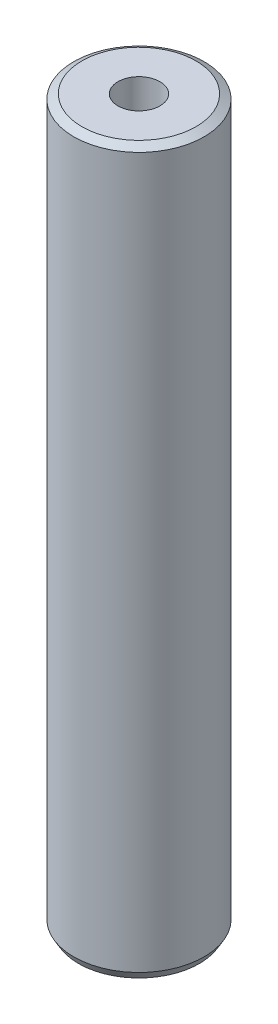
ISO-10303-21;
HEADER;
FILE_DESCRIPTION(('STEP AP214'),'2;1');
FILE_NAME('part.step','',(''),(''),'','','');
FILE_SCHEMA(('AUTOMOTIVE_DESIGN { 1 0 10303 214 1 1 1 1 }'));
ENDSEC;
DATA;
#1=APPLICATION_CONTEXT('core data for automotive mechanical design processes');
#2=APPLICATION_PROTOCOL_DEFINITION('international standard','automotive_design',2000,#1);
#3=PRODUCT_CONTEXT('',#1,'mechanical');
#4=PRODUCT('Part','Part','',(#3));
#5=PRODUCT_RELATED_PRODUCT_CATEGORY('part','',(#4));
#6=PRODUCT_DEFINITION_FORMATION('','',#4);
#7=PRODUCT_DEFINITION_CONTEXT('part definition',#1,'design');
#8=PRODUCT_DEFINITION('design','',#6,#7);
#9=PRODUCT_DEFINITION_SHAPE('','',#8);
#10=(LENGTH_UNIT() NAMED_UNIT(*) SI_UNIT(.MILLI.,.METRE.));
#11=(NAMED_UNIT(*) PLANE_ANGLE_UNIT() SI_UNIT($,.RADIAN.));
#12=(NAMED_UNIT(*) SI_UNIT($,.STERADIAN.) SOLID_ANGLE_UNIT());
#13=UNCERTAINTY_MEASURE_WITH_UNIT(LENGTH_MEASURE(1.E-05),#10,'distance_accuracy_value','');
#14=(GEOMETRIC_REPRESENTATION_CONTEXT(3) GLOBAL_UNCERTAINTY_ASSIGNED_CONTEXT((#13)) GLOBAL_UNIT_ASSIGNED_CONTEXT((#10,
#11,#12)) REPRESENTATION_CONTEXT('',''));
#15=CARTESIAN_POINT('',(0.,0.,0.));
#16=DIRECTION('',(0.,0.,1.));
#17=DIRECTION('',(1.,0.,0.));
#18=AXIS2_PLACEMENT_3D('',#15,#16,#17);
#19=CARTESIAN_POINT('',(0.,277.359548343743,0.));
#20=DIRECTION('',(0.,-1.,0.));
#21=DIRECTION('',(0.,0.,-1.));
#22=AXIS2_PLACEMENT_3D('',#19,#20,#21);
#23=CYLINDRICAL_SURFACE('',#22,25.);
#24=CARTESIAN_POINT('',(0.,275.561500703349,0.));
#25=DIRECTION('',(0.,1.,0.));
#26=DIRECTION('',(0.,0.,1.));
#27=AXIS2_PLACEMENT_3D('',#24,#25,#26);
#28=CIRCLE('',#27,25.);
#29=CARTESIAN_POINT('',(0.,275.561500703349,25.));
#30=VERTEX_POINT('',#29);
#31=EDGE_CURVE('E50',#30,#30,#28,.F.);
#32=ORIENTED_EDGE('',*,*,#31,.T.);
#33=EDGE_LOOP('',(#32));
#34=FACE_BOUND('',#33,.T.);
#35=CARTESIAN_POINT('',(0.,3.11430986759192,0.));
#36=DIRECTION('',(0.,1.,0.));
#37=DIRECTION('',(0.,0.,1.));
#38=AXIS2_PLACEMENT_3D('',#35,#36,#37);
#39=CIRCLE('',#38,25.);
#40=CARTESIAN_POINT('',(0.,3.11430986759192,25.));
#41=VERTEX_POINT('',#40);
#42=EDGE_CURVE('E51',#41,#41,#39,.T.);
#43=ORIENTED_EDGE('',*,*,#42,.T.);
#44=EDGE_LOOP('',(#43));
#45=FACE_BOUND('',#44,.T.);
#46=ADVANCED_FACE('F39',(#34,#45),#23,.T.);
#47=CARTESIAN_POINT('',(0.,277.359548343743,0.));
#48=DIRECTION('',(0.,1.,0.));
#49=DIRECTION('',(0.,0.,1.));
#50=AXIS2_PLACEMENT_3D('',#47,#48,#49);
#51=PLANE('',#50);
#52=CARTESIAN_POINT('',(0.,277.359548343743,0.));
#53=DIRECTION('',(0.,1.,0.));
#54=DIRECTION('',(0.,0.,1.));
#55=AXIS2_PLACEMENT_3D('',#52,#53,#54);
#56=CIRCLE('',#55,21.8856901324079);
#57=CARTESIAN_POINT('',(0.,277.359548343743,21.8856901324079));
#58=VERTEX_POINT('',#57);
#59=EDGE_CURVE('E54',#58,#58,#56,.T.);
#60=ORIENTED_EDGE('',*,*,#59,.T.);
#61=EDGE_LOOP('',(#60));
#62=FACE_BOUND('',#61,.T.);
#63=CARTESIAN_POINT('',(0.,277.359548343743,0.));
#64=DIRECTION('',(0.,1.,0.));
#65=DIRECTION('',(0.,0.,1.));
#66=AXIS2_PLACEMENT_3D('',#63,#64,#65);
#67=CIRCLE('',#66,8.05876806364712);
#68=CARTESIAN_POINT('',(0.,277.359548343743,8.05876806364712));
#69=VERTEX_POINT('',#68);
#70=EDGE_CURVE('E58',#69,#69,#67,.T.);
#71=ORIENTED_EDGE('',*,*,#70,.F.);
#72=EDGE_LOOP('',(#71));
#73=FACE_BOUND('',#72,.T.);
#74=ADVANCED_FACE('F69',(#62,#73),#51,.T.);
#75=CARTESIAN_POINT('',(0.,0.,0.));
#76=DIRECTION('',(0.,1.,0.));
#77=DIRECTION('',(0.,0.,1.));
#78=AXIS2_PLACEMENT_3D('',#75,#76,#77);
#79=PLANE('',#78);
#80=CARTESIAN_POINT('',(0.,0.,0.));
#81=DIRECTION('',(0.,1.,0.));
#82=DIRECTION('',(0.,0.,1.));
#83=AXIS2_PLACEMENT_3D('',#80,#81,#82);
#84=CIRCLE('',#83,23.2019523596059);
#85=CARTESIAN_POINT('',(0.,0.,23.2019523596059));
#86=VERTEX_POINT('',#85);
#87=EDGE_CURVE('E10',#86,#86,#84,.F.);
#88=ORIENTED_EDGE('',*,*,#87,.T.);
#89=EDGE_LOOP('',(#88));
#90=FACE_BOUND('',#89,.T.);
#91=CARTESIAN_POINT('',(0.,0.,0.));
#92=DIRECTION('',(0.,1.,0.));
#93=DIRECTION('',(0.,0.,1.));
#94=AXIS2_PLACEMENT_3D('',#91,#92,#93);
#95=CIRCLE('',#94,8.05876806364712);
#96=CARTESIAN_POINT('',(0.,0.,8.05876806364712));
#97=VERTEX_POINT('',#96);
#98=EDGE_CURVE('E63',#97,#97,#95,.T.);
#99=ORIENTED_EDGE('',*,*,#98,.T.);
#100=EDGE_LOOP('',(#99));
#101=FACE_BOUND('',#100,.T.);
#102=ADVANCED_FACE('F75',(#90,#101),#79,.F.);
#103=CARTESIAN_POINT('',(0.,277.359548343743,0.));
#104=DIRECTION('',(0.,-1.,0.));
#105=DIRECTION('',(0.,0.,-1.));
#106=AXIS2_PLACEMENT_3D('',#103,#104,#105);
#107=CYLINDRICAL_SURFACE('',#106,8.05876806364712);
#108=ORIENTED_EDGE('',*,*,#70,.T.);
#109=EDGE_LOOP('',(#108));
#110=FACE_BOUND('',#109,.T.);
#111=ORIENTED_EDGE('',*,*,#98,.F.);
#112=EDGE_LOOP('',(#111));
#113=FACE_BOUND('',#112,.T.);
#114=ADVANCED_FACE('F70',(#110,#113),#107,.F.);
#115=CARTESIAN_POINT('',(0.,277.359548343743,0.));
#116=DIRECTION('',(0.,-1.,0.));
#117=DIRECTION('',(0.,0.,-1.));
#118=AXIS2_PLACEMENT_3D('',#115,#116,#117);
#119=CONICAL_SURFACE('',#118,21.8856901324079,1.04719755119658);
#120=ORIENTED_EDGE('',*,*,#31,.F.);
#121=EDGE_LOOP('',(#120));
#122=FACE_BOUND('',#121,.T.);
#123=ORIENTED_EDGE('',*,*,#59,.F.);
#124=EDGE_LOOP('',(#123));
#125=FACE_BOUND('',#124,.T.);
#126=ADVANCED_FACE('F81',(#122,#125),#119,.T.);
#127=CARTESIAN_POINT('',(0.,3.11430986759192,0.));
#128=DIRECTION('',(0.,1.,0.));
#129=DIRECTION('',(0.,0.,1.));
#130=AXIS2_PLACEMENT_3D('',#127,#128,#129);
#131=CONICAL_SURFACE('',#130,25.,0.523598775598302);
#132=ORIENTED_EDGE('',*,*,#87,.F.);
#133=EDGE_LOOP('',(#132));
#134=FACE_BOUND('',#133,.T.);
#135=ORIENTED_EDGE('',*,*,#42,.F.);
#136=EDGE_LOOP('',(#135));
#137=FACE_BOUND('',#136,.T.);
#138=ADVANCED_FACE('F45',(#134,#137),#131,.T.);
#139=CLOSED_SHELL('',(#46,#74,#102,#114,#126,#138));
#140=MANIFOLD_SOLID_BREP('B2',#139);
#141=ADVANCED_BREP_SHAPE_REPRESENTATION('',(#18,#140),#14);
#142=SHAPE_DEFINITION_REPRESENTATION(#9,#141);
ENDSEC;
END-ISO-10303-21;
